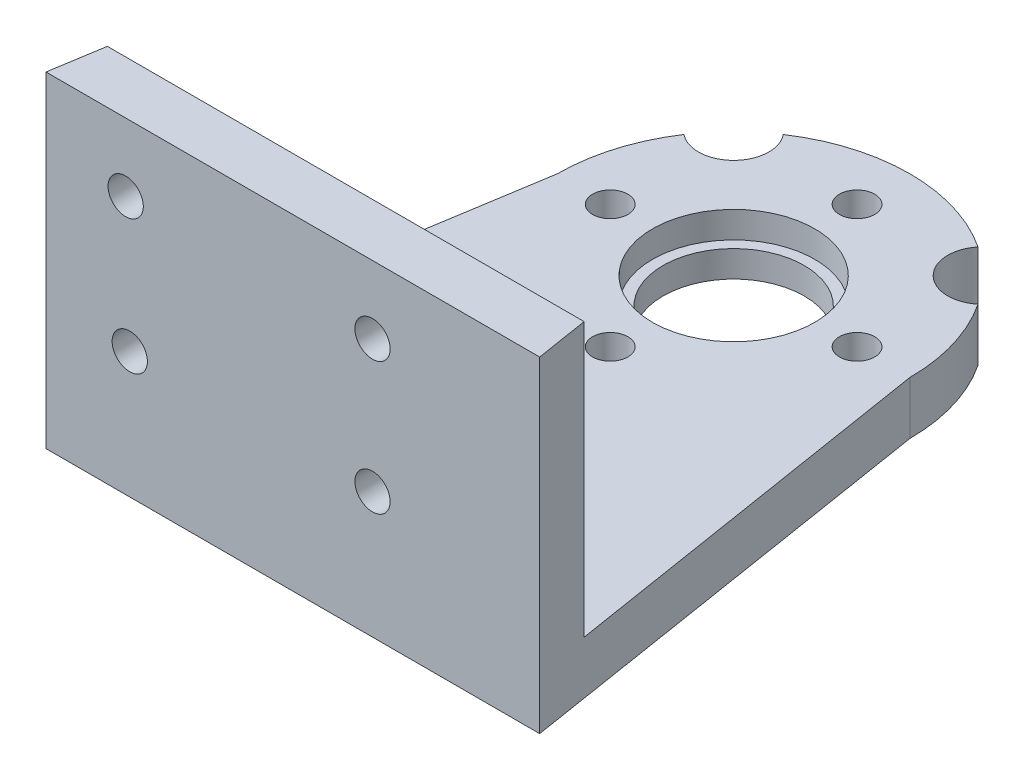
ISO-10303-21;
HEADER;
FILE_DESCRIPTION(('STEP AP214'),'2;1');
FILE_NAME('part.step','',(''),(''),'','','');
FILE_SCHEMA(('AUTOMOTIVE_DESIGN { 1 0 10303 214 1 1 1 1 }'));
ENDSEC;
DATA;
#1=APPLICATION_CONTEXT('core data for automotive mechanical design processes');
#2=APPLICATION_PROTOCOL_DEFINITION('international standard','automotive_design',2000,#1);
#3=PRODUCT_CONTEXT('',#1,'mechanical');
#4=PRODUCT('Part','Part','',(#3));
#5=PRODUCT_RELATED_PRODUCT_CATEGORY('part','',(#4));
#6=PRODUCT_DEFINITION_FORMATION('','',#4);
#7=PRODUCT_DEFINITION_CONTEXT('part definition',#1,'design');
#8=PRODUCT_DEFINITION('design','',#6,#7);
#9=PRODUCT_DEFINITION_SHAPE('','',#8);
#10=(LENGTH_UNIT() NAMED_UNIT(*) SI_UNIT(.MILLI.,.METRE.));
#11=(NAMED_UNIT(*) PLANE_ANGLE_UNIT() SI_UNIT($,.RADIAN.));
#12=(NAMED_UNIT(*) SI_UNIT($,.STERADIAN.) SOLID_ANGLE_UNIT());
#13=UNCERTAINTY_MEASURE_WITH_UNIT(LENGTH_MEASURE(1.E-05),#10,'distance_accuracy_value','');
#14=(GEOMETRIC_REPRESENTATION_CONTEXT(3) GLOBAL_UNCERTAINTY_ASSIGNED_CONTEXT((#13)) GLOBAL_UNIT_ASSIGNED_CONTEXT((#10,
#11,#12)) REPRESENTATION_CONTEXT('',''));
#15=CARTESIAN_POINT('',(0.,0.,0.));
#16=DIRECTION('',(0.,0.,1.));
#17=DIRECTION('',(1.,0.,0.));
#18=AXIS2_PLACEMENT_3D('',#15,#16,#17);
#19=CARTESIAN_POINT('',(0.,3.,0.));
#20=DIRECTION('',(0.,-1.,0.));
#21=DIRECTION('',(0.,0.,-1.));
#22=AXIS2_PLACEMENT_3D('',#19,#20,#21);
#23=CYLINDRICAL_SURFACE('',#22,10.);
#24=CARTESIAN_POINT('',(0.,0.,0.));
#25=DIRECTION('',(0.,1.,0.));
#26=DIRECTION('',(0.,0.,-1.));
#27=AXIS2_PLACEMENT_3D('',#24,#25,#26);
#28=CIRCLE('',#27,10.);
#29=CARTESIAN_POINT('',(10.,0.,0.));
#30=VERTEX_POINT('',#29);
#31=CARTESIAN_POINT('',(8.33677118357518,0.,-5.52252172768116));
#32=VERTEX_POINT('',#31);
#33=EDGE_CURVE('E221',#30,#32,#28,.T.);
#34=ORIENTED_EDGE('',*,*,#33,.T.);
#35=DIRECTION('',(0.,1.,0.));
#36=VECTOR('',#35,1.);
#37=CARTESIAN_POINT('',(8.33677118357519,-2.,-5.52252172768115));
#38=LINE('',#37,#36);
#39=CARTESIAN_POINT('',(8.33677118357519,3.,-5.52252172768115));
#40=VERTEX_POINT('',#39);
#41=EDGE_CURVE('E51',#32,#40,#38,.T.);
#42=ORIENTED_EDGE('',*,*,#41,.T.);
#43=CARTESIAN_POINT('',(0.,3.,0.));
#44=DIRECTION('',(0.,1.,0.));
#45=DIRECTION('',(0.,0.,-1.));
#46=AXIS2_PLACEMENT_3D('',#43,#44,#45);
#47=CIRCLE('',#46,10.);
#48=CARTESIAN_POINT('',(10.,3.,0.));
#49=VERTEX_POINT('',#48);
#50=EDGE_CURVE('E125',#49,#40,#47,.T.);
#51=ORIENTED_EDGE('',*,*,#50,.F.);
#52=DIRECTION('',(0.,-1.,0.));
#53=VECTOR('',#52,1.);
#54=CARTESIAN_POINT('',(10.,3.,0.));
#55=LINE('',#54,#53);
#56=EDGE_CURVE('E149',#49,#30,#55,.T.);
#57=ORIENTED_EDGE('',*,*,#56,.T.);
#58=EDGE_LOOP('',(#34,#42,#51,#57));
#59=FACE_BOUND('',#58,.T.);
#60=ADVANCED_FACE('F37',(#59),#23,.T.);
#61=CARTESIAN_POINT('',(5.52252172768112,3.,-8.33677118357521));
#62=VERTEX_POINT('',#61);
#63=CARTESIAN_POINT('',(-5.52252172768112,3.,-8.33677118357521));
#64=VERTEX_POINT('',#63);
#65=EDGE_CURVE('E122',#62,#64,#47,.T.);
#66=ORIENTED_EDGE('',*,*,#65,.F.);
#67=DIRECTION('',(0.,1.,0.));
#68=VECTOR('',#67,1.);
#69=CARTESIAN_POINT('',(5.52252172768112,-2.,-8.33677118357521));
#70=LINE('',#69,#68);
#71=CARTESIAN_POINT('',(5.52252172768113,0.,-8.3367711835752));
#72=VERTEX_POINT('',#71);
#73=EDGE_CURVE('E112',#62,#72,#70,.F.);
#74=ORIENTED_EDGE('',*,*,#73,.T.);
#75=CARTESIAN_POINT('',(-5.52252172768113,0.,-8.3367711835752));
#76=VERTEX_POINT('',#75);
#77=EDGE_CURVE('E59',#72,#76,#28,.T.);
#78=ORIENTED_EDGE('',*,*,#77,.T.);
#79=DIRECTION('',(0.,1.,0.));
#80=VECTOR('',#79,1.);
#81=CARTESIAN_POINT('',(-5.52252172768112,-2.,-8.33677118357521));
#82=LINE('',#81,#80);
#83=EDGE_CURVE('E129',#76,#64,#82,.T.);
#84=ORIENTED_EDGE('',*,*,#83,.T.);
#85=EDGE_LOOP('',(#66,#74,#78,#84));
#86=FACE_BOUND('',#85,.T.);
#87=ADVANCED_FACE('F128',(#86),#23,.T.);
#88=CARTESIAN_POINT('',(0.,-10.,0.));
#89=DIRECTION('',(0.,1.,0.));
#90=DIRECTION('',(0.,0.,1.));
#91=AXIS2_PLACEMENT_3D('',#88,#89,#90);
#92=CYLINDRICAL_SURFACE('',#91,4.);
#93=CARTESIAN_POINT('',(0.,0.,0.));
#94=DIRECTION('',(0.,-1.,0.));
#95=DIRECTION('',(0.,0.,-1.));
#96=AXIS2_PLACEMENT_3D('',#93,#94,#95);
#97=CIRCLE('',#96,4.);
#98=CARTESIAN_POINT('',(0.,0.,-4.));
#99=VERTEX_POINT('',#98);
#100=EDGE_CURVE('E217',#99,#99,#97,.T.);
#101=ORIENTED_EDGE('',*,*,#100,.T.);
#102=EDGE_LOOP('',(#101));
#103=FACE_BOUND('',#102,.T.);
#104=CARTESIAN_POINT('',(0.,1.5,0.));
#105=DIRECTION('',(0.,1.,0.));
#106=DIRECTION('',(0.,0.,1.));
#107=AXIS2_PLACEMENT_3D('',#104,#105,#106);
#108=CIRCLE('',#107,4.);
#109=CARTESIAN_POINT('',(0.,1.5,4.));
#110=VERTEX_POINT('',#109);
#111=EDGE_CURVE('E155',#110,#110,#108,.F.);
#112=ORIENTED_EDGE('',*,*,#111,.F.);
#113=EDGE_LOOP('',(#112));
#114=FACE_BOUND('',#113,.T.);
#115=ADVANCED_FACE('F352',(#103,#114),#92,.F.);
#116=CARTESIAN_POINT('',(0.,3.,0.));
#117=DIRECTION('',(0.,-1.,0.));
#118=DIRECTION('',(0.,0.,-1.));
#119=AXIS2_PLACEMENT_3D('',#116,#117,#118);
#120=PLANE('',#119);
#121=CARTESIAN_POINT('',(0.,3.,0.));
#122=DIRECTION('',(0.,1.,0.));
#123=DIRECTION('',(0.,0.,1.));
#124=AXIS2_PLACEMENT_3D('',#121,#122,#123);
#125=CIRCLE('',#124,4.6);
#126=CARTESIAN_POINT('',(0.,3.,4.6));
#127=VERTEX_POINT('',#126);
#128=EDGE_CURVE('E276',#127,#127,#125,.T.);
#129=ORIENTED_EDGE('',*,*,#128,.F.);
#130=EDGE_LOOP('',(#129));
#131=FACE_BOUND('',#130,.T.);
#132=CARTESIAN_POINT('',(-6.52,3.,19.));
#133=DIRECTION('',(0.,1.,0.));
#134=DIRECTION('',(0.,0.,1.));
#135=AXIS2_PLACEMENT_3D('',#132,#133,#134);
#136=CIRCLE('',#135,1.);
#137=CARTESIAN_POINT('',(-6.52,3.,20.));
#138=VERTEX_POINT('',#137);
#139=EDGE_CURVE('E136',#138,#138,#136,.T.);
#140=ORIENTED_EDGE('',*,*,#139,.F.);
#141=EDGE_LOOP('',(#140));
#142=FACE_BOUND('',#141,.T.);
#143=CARTESIAN_POINT('',(6.52,3.,19.));
#144=DIRECTION('',(0.,1.,0.));
#145=DIRECTION('',(0.,0.,-1.));
#146=AXIS2_PLACEMENT_3D('',#143,#144,#145);
#147=CIRCLE('',#146,1.);
#148=CARTESIAN_POINT('',(6.52,3.,18.));
#149=VERTEX_POINT('',#148);
#150=EDGE_CURVE('E190',#149,#149,#147,.T.);
#151=ORIENTED_EDGE('',*,*,#150,.F.);
#152=EDGE_LOOP('',(#151));
#153=FACE_BOUND('',#152,.T.);
#154=CARTESIAN_POINT('',(0.,3.,19.));
#155=DIRECTION('',(0.,1.,0.));
#156=DIRECTION('',(0.,0.,1.));
#157=AXIS2_PLACEMENT_3D('',#154,#155,#156);
#158=CIRCLE('',#157,1.);
#159=CARTESIAN_POINT('',(0.,3.,20.));
#160=VERTEX_POINT('',#159);
#161=EDGE_CURVE('E186',#160,#160,#158,.T.);
#162=ORIENTED_EDGE('',*,*,#161,.F.);
#163=EDGE_LOOP('',(#162));
#164=FACE_BOUND('',#163,.T.);
#165=CARTESIAN_POINT('',(0.,3.,7.));
#166=DIRECTION('',(0.,1.,0.));
#167=DIRECTION('',(0.,0.,1.));
#168=AXIS2_PLACEMENT_3D('',#165,#166,#167);
#169=CIRCLE('',#168,1.);
#170=CARTESIAN_POINT('',(0.,3.,8.));
#171=VERTEX_POINT('',#170);
#172=EDGE_CURVE('E180',#171,#171,#169,.T.);
#173=ORIENTED_EDGE('',*,*,#172,.F.);
#174=EDGE_LOOP('',(#173));
#175=FACE_BOUND('',#174,.T.);
#176=CARTESIAN_POINT('',(-7.,3.,0.));
#177=DIRECTION('',(0.,1.,0.));
#178=DIRECTION('',(0.,0.,1.));
#179=AXIS2_PLACEMENT_3D('',#176,#177,#178);
#180=CIRCLE('',#179,1.);
#181=CARTESIAN_POINT('',(-7.,3.,0.999999999999975));
#182=VERTEX_POINT('',#181);
#183=EDGE_CURVE('E174',#182,#182,#180,.T.);
#184=ORIENTED_EDGE('',*,*,#183,.F.);
#185=EDGE_LOOP('',(#184));
#186=FACE_BOUND('',#185,.T.);
#187=CARTESIAN_POINT('',(0.,3.,-7.));
#188=DIRECTION('',(0.,1.,0.));
#189=DIRECTION('',(0.,0.,1.));
#190=AXIS2_PLACEMENT_3D('',#187,#188,#189);
#191=CIRCLE('',#190,1.);
#192=CARTESIAN_POINT('',(0.,3.,-6.));
#193=VERTEX_POINT('',#192);
#194=EDGE_CURVE('E166',#193,#193,#191,.T.);
#195=ORIENTED_EDGE('',*,*,#194,.F.);
#196=EDGE_LOOP('',(#195));
#197=FACE_BOUND('',#196,.T.);
#198=CARTESIAN_POINT('',(7.,3.,0.));
#199=DIRECTION('',(0.,1.,0.));
#200=DIRECTION('',(0.,0.,1.));
#201=AXIS2_PLACEMENT_3D('',#198,#199,#200);
#202=CIRCLE('',#201,1.);
#203=CARTESIAN_POINT('',(7.,3.,1.00000000000007));
#204=VERTEX_POINT('',#203);
#205=EDGE_CURVE('E167',#204,#204,#202,.T.);
#206=ORIENTED_EDGE('',*,*,#205,.F.);
#207=EDGE_LOOP('',(#206));
#208=FACE_BOUND('',#207,.T.);
#209=ORIENTED_EDGE('',*,*,#50,.T.);
#210=CARTESIAN_POINT('',(7.07106781186546,3.,-7.07106781186549));
#211=DIRECTION('',(0.,1.,0.));
#212=DIRECTION('',(0.,0.,-1.));
#213=AXIS2_PLACEMENT_3D('',#210,#211,#212);
#214=CIRCLE('',#213,2.);
#215=EDGE_CURVE('E115',#62,#40,#214,.T.);
#216=ORIENTED_EDGE('',*,*,#215,.F.);
#217=ORIENTED_EDGE('',*,*,#65,.T.);
#218=CARTESIAN_POINT('',(-7.07106781186546,3.,-7.07106781186549));
#219=DIRECTION('',(0.,1.,0.));
#220=DIRECTION('',(0.,0.,1.));
#221=AXIS2_PLACEMENT_3D('',#218,#219,#220);
#222=CIRCLE('',#221,2.);
#223=CARTESIAN_POINT('',(-8.33677118357519,3.,-5.52252172768115));
#224=VERTEX_POINT('',#223);
#225=EDGE_CURVE('E284',#224,#64,#222,.T.);
#226=ORIENTED_EDGE('',*,*,#225,.F.);
#227=CARTESIAN_POINT('',(-10.,3.,0.));
#228=VERTEX_POINT('',#227);
#229=EDGE_CURVE('E130',#224,#228,#47,.T.);
#230=ORIENTED_EDGE('',*,*,#229,.T.);
#231=DIRECTION('',(-0.157990501106673,0.,0.987440631916705));
#232=VECTOR('',#231,1.);
#233=CARTESIAN_POINT('',(-10.,3.,0.));
#234=LINE('',#233,#232);
#235=CARTESIAN_POINT('',(-13.52,3.,22.));
#236=VERTEX_POINT('',#235);
#237=EDGE_CURVE('E132',#228,#236,#234,.T.);
#238=ORIENTED_EDGE('',*,*,#237,.T.);
#239=DIRECTION('',(-1.,0.,0.));
#240=VECTOR('',#239,1.);
#241=CARTESIAN_POINT('',(-13.52,3.,22.));
#242=LINE('',#241,#240);
#243=CARTESIAN_POINT('',(13.52,3.,22.));
#244=VERTEX_POINT('',#243);
#245=EDGE_CURVE('E150',#244,#236,#242,.T.);
#246=ORIENTED_EDGE('',*,*,#245,.F.);
#247=DIRECTION('',(-0.157990501106673,0.,-0.987440631916705));
#248=VECTOR('',#247,1.);
#249=CARTESIAN_POINT('',(10.,3.,0.));
#250=LINE('',#249,#248);
#251=EDGE_CURVE('E145',#244,#49,#250,.T.);
#252=ORIENTED_EDGE('',*,*,#251,.T.);
#253=EDGE_LOOP('',(#209,#216,#217,#226,#230,#238,#246,#252));
#254=FACE_BOUND('',#253,.T.);
#255=ADVANCED_FACE('F120',(#131,#142,#153,#164,#175,#186,#197,#208,#254),#120,.F.);
#256=ORIENTED_EDGE('',*,*,#229,.F.);
#257=DIRECTION('',(0.,1.,0.));
#258=VECTOR('',#257,1.);
#259=CARTESIAN_POINT('',(-8.33677118357519,-2.,-5.52252172768115));
#260=LINE('',#259,#258);
#261=CARTESIAN_POINT('',(-8.33677118357518,0.,-5.52252172768116));
#262=VERTEX_POINT('',#261);
#263=EDGE_CURVE('E282',#224,#262,#260,.F.);
#264=ORIENTED_EDGE('',*,*,#263,.T.);
#265=CARTESIAN_POINT('',(-10.,0.,0.));
#266=VERTEX_POINT('',#265);
#267=EDGE_CURVE('E219',#262,#266,#28,.T.);
#268=ORIENTED_EDGE('',*,*,#267,.T.);
#269=DIRECTION('',(0.,-1.,0.));
#270=VECTOR('',#269,1.);
#271=CARTESIAN_POINT('',(-10.,3.,0.));
#272=LINE('',#271,#270);
#273=EDGE_CURVE('E224',#228,#266,#272,.T.);
#274=ORIENTED_EDGE('',*,*,#273,.F.);
#275=EDGE_LOOP('',(#256,#264,#268,#274));
#276=FACE_BOUND('',#275,.T.);
#277=ADVANCED_FACE('F39',(#276),#23,.T.);
#278=CARTESIAN_POINT('',(-10.,3.,0.));
#279=DIRECTION('',(0.987440631916705,0.,0.157990501106673));
#280=DIRECTION('',(0.157990501106673,0.,-0.987440631916705));
#281=AXIS2_PLACEMENT_3D('',#278,#279,#280);
#282=PLANE('',#281);
#283=DIRECTION('',(-0.157990501106673,0.,0.987440631916705));
#284=VECTOR('',#283,1.);
#285=CARTESIAN_POINT('',(-10.,0.,0.));
#286=LINE('',#285,#284);
#287=CARTESIAN_POINT('',(-14.,0.,25.));
#288=VERTEX_POINT('',#287);
#289=EDGE_CURVE('E238',#266,#288,#286,.T.);
#290=ORIENTED_EDGE('',*,*,#289,.T.);
#291=DIRECTION('',(0.,-1.,0.));
#292=VECTOR('',#291,1.);
#293=CARTESIAN_POINT('',(-14.,3.,25.));
#294=LINE('',#293,#292);
#295=CARTESIAN_POINT('',(-14.,18.5,25.));
#296=VERTEX_POINT('',#295);
#297=EDGE_CURVE('E227',#296,#288,#294,.T.);
#298=ORIENTED_EDGE('',*,*,#297,.F.);
#299=DIRECTION('',(-0.157990501106673,0.,0.987440631916705));
#300=VECTOR('',#299,1.);
#301=CARTESIAN_POINT('',(-13.52,18.5,22.));
#302=LINE('',#301,#300);
#303=CARTESIAN_POINT('',(-13.52,18.5,22.));
#304=VERTEX_POINT('',#303);
#305=EDGE_CURVE('E154',#304,#296,#302,.T.);
#306=ORIENTED_EDGE('',*,*,#305,.F.);
#307=DIRECTION('',(0.,-1.,0.));
#308=VECTOR('',#307,1.);
#309=CARTESIAN_POINT('',(-13.52,18.5,22.));
#310=LINE('',#309,#308);
#311=EDGE_CURVE('E156',#304,#236,#310,.T.);
#312=ORIENTED_EDGE('',*,*,#311,.T.);
#313=ORIENTED_EDGE('',*,*,#237,.F.);
#314=ORIENTED_EDGE('',*,*,#273,.T.);
#315=EDGE_LOOP('',(#290,#298,#306,#312,#313,#314));
#316=FACE_BOUND('',#315,.T.);
#317=ADVANCED_FACE('F330',(#316),#282,.F.);
#318=CARTESIAN_POINT('',(-14.,3.,25.));
#319=DIRECTION('',(0.,0.,-1.));
#320=DIRECTION('',(-1.,0.,0.));
#321=AXIS2_PLACEMENT_3D('',#318,#319,#320);
#322=PLANE('',#321);
#323=CARTESIAN_POINT('',(-9.24883244461862,7.15183711810638,25.));
#324=DIRECTION('',(0.,0.,-1.));
#325=DIRECTION('',(-1.,0.,0.));
#326=AXIS2_PLACEMENT_3D('',#323,#324,#325);
#327=CIRCLE('',#326,1.00000000002276);
#328=CARTESIAN_POINT('',(-10.2488324446414,7.15183711810638,25.));
#329=VERTEX_POINT('',#328);
#330=EDGE_CURVE('E304',#329,#329,#327,.T.);
#331=ORIENTED_EDGE('',*,*,#330,.T.);
#332=EDGE_LOOP('',(#331));
#333=FACE_BOUND('',#332,.T.);
#334=CARTESIAN_POINT('',(-9.48122486488474,14.6518371181064,25.));
#335=DIRECTION('',(0.,0.,-1.));
#336=DIRECTION('',(-1.,0.,0.));
#337=AXIS2_PLACEMENT_3D('',#334,#335,#336);
#338=CIRCLE('',#337,1.00000000002276);
#339=CARTESIAN_POINT('',(-10.4812248649075,14.6518371181064,25.));
#340=VERTEX_POINT('',#339);
#341=EDGE_CURVE('E298',#340,#340,#338,.T.);
#342=ORIENTED_EDGE('',*,*,#341,.T.);
#343=EDGE_LOOP('',(#342));
#344=FACE_BOUND('',#343,.T.);
#345=CARTESIAN_POINT('',(4.51877513511526,14.6518371181064,25.));
#346=DIRECTION('',(0.,0.,-1.));
#347=DIRECTION('',(-1.,0.,0.));
#348=AXIS2_PLACEMENT_3D('',#345,#346,#347);
#349=CIRCLE('',#348,1.00000000002276);
#350=CARTESIAN_POINT('',(3.5187751350925,14.6518371181064,25.));
#351=VERTEX_POINT('',#350);
#352=EDGE_CURVE('E292',#351,#351,#349,.T.);
#353=ORIENTED_EDGE('',*,*,#352,.T.);
#354=EDGE_LOOP('',(#353));
#355=FACE_BOUND('',#354,.T.);
#356=CARTESIAN_POINT('',(4.51877513511526,7.15183711810639,25.));
#357=DIRECTION('',(0.,0.,-1.));
#358=DIRECTION('',(-1.,0.,0.));
#359=AXIS2_PLACEMENT_3D('',#356,#357,#358);
#360=CIRCLE('',#359,1.00000000002276);
#361=CARTESIAN_POINT('',(3.5187751350925,7.15183711810639,25.));
#362=VERTEX_POINT('',#361);
#363=EDGE_CURVE('E126',#362,#362,#360,.T.);
#364=ORIENTED_EDGE('',*,*,#363,.T.);
#365=EDGE_LOOP('',(#364));
#366=FACE_BOUND('',#365,.T.);
#367=DIRECTION('',(1.,0.,0.));
#368=VECTOR('',#367,1.);
#369=CARTESIAN_POINT('',(-14.,0.,25.));
#370=LINE('',#369,#368);
#371=CARTESIAN_POINT('',(14.,0.,25.));
#372=VERTEX_POINT('',#371);
#373=EDGE_CURVE('E236',#288,#372,#370,.T.);
#374=ORIENTED_EDGE('',*,*,#373,.T.);
#375=DIRECTION('',(0.,-1.,0.));
#376=VECTOR('',#375,1.);
#377=CARTESIAN_POINT('',(14.,3.,25.));
#378=LINE('',#377,#376);
#379=CARTESIAN_POINT('',(14.,18.5,25.));
#380=VERTEX_POINT('',#379);
#381=EDGE_CURVE('E230',#380,#372,#378,.T.);
#382=ORIENTED_EDGE('',*,*,#381,.F.);
#383=DIRECTION('',(1.,0.,0.));
#384=VECTOR('',#383,1.);
#385=CARTESIAN_POINT('',(-14.,18.5,25.));
#386=LINE('',#385,#384);
#387=EDGE_CURVE('E270',#296,#380,#386,.T.);
#388=ORIENTED_EDGE('',*,*,#387,.F.);
#389=ORIENTED_EDGE('',*,*,#297,.T.);
#390=EDGE_LOOP('',(#374,#382,#388,#389));
#391=FACE_BOUND('',#390,.T.);
#392=ADVANCED_FACE('F329',(#333,#344,#355,#366,#391),#322,.F.);
#393=CARTESIAN_POINT('',(10.,3.,0.));
#394=DIRECTION('',(-0.987440631916705,0.,0.157990501106673));
#395=DIRECTION('',(0.157990501106673,0.,0.987440631916705));
#396=AXIS2_PLACEMENT_3D('',#393,#394,#395);
#397=PLANE('',#396);
#398=DIRECTION('',(-0.157990501106673,0.,-0.987440631916705));
#399=VECTOR('',#398,1.);
#400=CARTESIAN_POINT('',(10.,0.,0.));
#401=LINE('',#400,#399);
#402=EDGE_CURVE('E133',#372,#30,#401,.T.);
#403=ORIENTED_EDGE('',*,*,#402,.T.);
#404=ORIENTED_EDGE('',*,*,#56,.F.);
#405=ORIENTED_EDGE('',*,*,#251,.F.);
#406=DIRECTION('',(0.,-1.,0.));
#407=VECTOR('',#406,1.);
#408=CARTESIAN_POINT('',(13.52,18.5,22.));
#409=LINE('',#408,#407);
#410=CARTESIAN_POINT('',(13.52,18.5,22.));
#411=VERTEX_POINT('',#410);
#412=EDGE_CURVE('E170',#411,#244,#409,.T.);
#413=ORIENTED_EDGE('',*,*,#412,.F.);
#414=DIRECTION('',(-0.157990501106673,0.,-0.987440631916705));
#415=VECTOR('',#414,1.);
#416=CARTESIAN_POINT('',(14.,18.5,25.));
#417=LINE('',#416,#415);
#418=EDGE_CURVE('E267',#380,#411,#417,.T.);
#419=ORIENTED_EDGE('',*,*,#418,.F.);
#420=ORIENTED_EDGE('',*,*,#381,.T.);
#421=EDGE_LOOP('',(#403,#404,#405,#413,#419,#420));
#422=FACE_BOUND('',#421,.T.);
#423=ADVANCED_FACE('F206',(#422),#397,.F.);
#424=CARTESIAN_POINT('',(0.,0.,0.));
#425=DIRECTION('',(0.,-1.,0.));
#426=DIRECTION('',(0.,0.,-1.));
#427=AXIS2_PLACEMENT_3D('',#424,#425,#426);
#428=PLANE('',#427);
#429=CARTESIAN_POINT('',(7.07106781186546,0.,-7.07106781186549));
#430=DIRECTION('',(0.,-1.,0.));
#431=DIRECTION('',(0.,0.,-1.));
#432=AXIS2_PLACEMENT_3D('',#429,#430,#431);
#433=CIRCLE('',#432,2.);
#434=EDGE_CURVE('E11',#32,#72,#433,.T.);
#435=ORIENTED_EDGE('',*,*,#434,.F.);
#436=ORIENTED_EDGE('',*,*,#33,.F.);
#437=ORIENTED_EDGE('',*,*,#402,.F.);
#438=ORIENTED_EDGE('',*,*,#373,.F.);
#439=ORIENTED_EDGE('',*,*,#289,.F.);
#440=ORIENTED_EDGE('',*,*,#267,.F.);
#441=CARTESIAN_POINT('',(-7.07106781186546,0.,-7.07106781186549));
#442=DIRECTION('',(0.,-1.,0.));
#443=DIRECTION('',(0.,0.,-1.));
#444=AXIS2_PLACEMENT_3D('',#441,#442,#443);
#445=CIRCLE('',#444,2.);
#446=EDGE_CURVE('E45',#76,#262,#445,.T.);
#447=ORIENTED_EDGE('',*,*,#446,.F.);
#448=ORIENTED_EDGE('',*,*,#77,.F.);
#449=EDGE_LOOP('',(#435,#436,#437,#438,#439,#440,#447,#448));
#450=FACE_BOUND('',#449,.T.);
#451=CARTESIAN_POINT('',(7.,0.,0.));
#452=DIRECTION('',(0.,1.,0.));
#453=DIRECTION('',(0.,0.,1.));
#454=AXIS2_PLACEMENT_3D('',#451,#452,#453);
#455=CIRCLE('',#454,1.);
#456=CARTESIAN_POINT('',(7.,0.,1.00000000000007));
#457=VERTEX_POINT('',#456);
#458=EDGE_CURVE('E163',#457,#457,#455,.T.);
#459=ORIENTED_EDGE('',*,*,#458,.T.);
#460=EDGE_LOOP('',(#459));
#461=FACE_BOUND('',#460,.T.);
#462=CARTESIAN_POINT('',(0.,0.,-7.));
#463=DIRECTION('',(0.,1.,0.));
#464=DIRECTION('',(0.,0.,1.));
#465=AXIS2_PLACEMENT_3D('',#462,#463,#464);
#466=CIRCLE('',#465,1.);
#467=CARTESIAN_POINT('',(0.,0.,-6.));
#468=VERTEX_POINT('',#467);
#469=EDGE_CURVE('E171',#468,#468,#466,.T.);
#470=ORIENTED_EDGE('',*,*,#469,.T.);
#471=EDGE_LOOP('',(#470));
#472=FACE_BOUND('',#471,.T.);
#473=CARTESIAN_POINT('',(-7.,0.,0.));
#474=DIRECTION('',(0.,1.,0.));
#475=DIRECTION('',(0.,0.,1.));
#476=AXIS2_PLACEMENT_3D('',#473,#474,#475);
#477=CIRCLE('',#476,1.);
#478=CARTESIAN_POINT('',(-7.,0.,0.999999999999975));
#479=VERTEX_POINT('',#478);
#480=EDGE_CURVE('E177',#479,#479,#477,.T.);
#481=ORIENTED_EDGE('',*,*,#480,.T.);
#482=EDGE_LOOP('',(#481));
#483=FACE_BOUND('',#482,.T.);
#484=CARTESIAN_POINT('',(0.,0.,7.));
#485=DIRECTION('',(0.,1.,0.));
#486=DIRECTION('',(0.,0.,1.));
#487=AXIS2_PLACEMENT_3D('',#484,#485,#486);
#488=CIRCLE('',#487,1.);
#489=CARTESIAN_POINT('',(0.,0.,8.));
#490=VERTEX_POINT('',#489);
#491=EDGE_CURVE('E183',#490,#490,#488,.T.);
#492=ORIENTED_EDGE('',*,*,#491,.T.);
#493=EDGE_LOOP('',(#492));
#494=FACE_BOUND('',#493,.T.);
#495=CARTESIAN_POINT('',(0.,0.,19.));
#496=DIRECTION('',(0.,-1.,0.));
#497=DIRECTION('',(0.,0.,-1.));
#498=AXIS2_PLACEMENT_3D('',#495,#496,#497);
#499=CIRCLE('',#498,1.);
#500=CARTESIAN_POINT('',(0.,0.,18.));
#501=VERTEX_POINT('',#500);
#502=EDGE_CURVE('E146',#501,#501,#499,.T.);
#503=ORIENTED_EDGE('',*,*,#502,.F.);
#504=EDGE_LOOP('',(#503));
#505=FACE_BOUND('',#504,.T.);
#506=CARTESIAN_POINT('',(6.52,0.,19.));
#507=DIRECTION('',(0.,-1.,0.));
#508=DIRECTION('',(0.,0.,-1.));
#509=AXIS2_PLACEMENT_3D('',#506,#507,#508);
#510=CIRCLE('',#509,1.);
#511=CARTESIAN_POINT('',(6.52,0.,18.));
#512=VERTEX_POINT('',#511);
#513=EDGE_CURVE('E192',#512,#512,#510,.T.);
#514=ORIENTED_EDGE('',*,*,#513,.F.);
#515=EDGE_LOOP('',(#514));
#516=FACE_BOUND('',#515,.T.);
#517=CARTESIAN_POINT('',(-6.52,0.,19.));
#518=DIRECTION('',(0.,-1.,0.));
#519=DIRECTION('',(0.,0.,-1.));
#520=AXIS2_PLACEMENT_3D('',#517,#518,#519);
#521=CIRCLE('',#520,1.);
#522=CARTESIAN_POINT('',(-6.52,0.,18.));
#523=VERTEX_POINT('',#522);
#524=EDGE_CURVE('E214',#523,#523,#521,.T.);
#525=ORIENTED_EDGE('',*,*,#524,.F.);
#526=EDGE_LOOP('',(#525));
#527=FACE_BOUND('',#526,.T.);
#528=ORIENTED_EDGE('',*,*,#100,.F.);
#529=EDGE_LOOP('',(#528));
#530=FACE_BOUND('',#529,.T.);
#531=ADVANCED_FACE('F202',(#450,#461,#472,#483,#494,#505,#516,#527,#530),#428,.T.);
#532=CARTESIAN_POINT('',(-6.52,-10.,19.));
#533=DIRECTION('',(0.,1.,0.));
#534=DIRECTION('',(0.,0.,1.));
#535=AXIS2_PLACEMENT_3D('',#532,#533,#534);
#536=CYLINDRICAL_SURFACE('',#535,1.);
#537=ORIENTED_EDGE('',*,*,#524,.T.);
#538=EDGE_LOOP('',(#537));
#539=FACE_BOUND('',#538,.T.);
#540=ORIENTED_EDGE('',*,*,#139,.T.);
#541=EDGE_LOOP('',(#540));
#542=FACE_BOUND('',#541,.T.);
#543=ADVANCED_FACE('F205',(#539,#542),#536,.F.);
#544=CARTESIAN_POINT('',(6.52,-10.,19.));
#545=DIRECTION('',(0.,1.,0.));
#546=DIRECTION('',(0.,0.,1.));
#547=AXIS2_PLACEMENT_3D('',#544,#545,#546);
#548=CYLINDRICAL_SURFACE('',#547,1.);
#549=ORIENTED_EDGE('',*,*,#513,.T.);
#550=EDGE_LOOP('',(#549));
#551=FACE_BOUND('',#550,.T.);
#552=ORIENTED_EDGE('',*,*,#150,.T.);
#553=EDGE_LOOP('',(#552));
#554=FACE_BOUND('',#553,.T.);
#555=ADVANCED_FACE('F490',(#551,#554),#548,.F.);
#556=CARTESIAN_POINT('',(0.,-10.,19.));
#557=DIRECTION('',(0.,1.,0.));
#558=DIRECTION('',(0.,0.,1.));
#559=AXIS2_PLACEMENT_3D('',#556,#557,#558);
#560=CYLINDRICAL_SURFACE('',#559,1.);
#561=ORIENTED_EDGE('',*,*,#502,.T.);
#562=EDGE_LOOP('',(#561));
#563=FACE_BOUND('',#562,.T.);
#564=ORIENTED_EDGE('',*,*,#161,.T.);
#565=EDGE_LOOP('',(#564));
#566=FACE_BOUND('',#565,.T.);
#567=ADVANCED_FACE('F199',(#563,#566),#560,.F.);
#568=CARTESIAN_POINT('',(0.,0.,7.));
#569=DIRECTION('',(0.,1.,0.));
#570=DIRECTION('',(0.,0.,1.));
#571=AXIS2_PLACEMENT_3D('',#568,#569,#570);
#572=CYLINDRICAL_SURFACE('',#571,1.);
#573=ORIENTED_EDGE('',*,*,#491,.F.);
#574=EDGE_LOOP('',(#573));
#575=FACE_BOUND('',#574,.T.);
#576=ORIENTED_EDGE('',*,*,#172,.T.);
#577=EDGE_LOOP('',(#576));
#578=FACE_BOUND('',#577,.T.);
#579=ADVANCED_FACE('F503',(#575,#578),#572,.F.);
#580=CARTESIAN_POINT('',(-7.,0.,0.));
#581=DIRECTION('',(0.,1.,0.));
#582=DIRECTION('',(0.,0.,1.));
#583=AXIS2_PLACEMENT_3D('',#580,#581,#582);
#584=CYLINDRICAL_SURFACE('',#583,1.);
#585=ORIENTED_EDGE('',*,*,#480,.F.);
#586=EDGE_LOOP('',(#585));
#587=FACE_BOUND('',#586,.T.);
#588=ORIENTED_EDGE('',*,*,#183,.T.);
#589=EDGE_LOOP('',(#588));
#590=FACE_BOUND('',#589,.T.);
#591=ADVANCED_FACE('F510',(#587,#590),#584,.F.);
#592=CARTESIAN_POINT('',(0.,0.,-7.));
#593=DIRECTION('',(0.,1.,0.));
#594=DIRECTION('',(0.,0.,1.));
#595=AXIS2_PLACEMENT_3D('',#592,#593,#594);
#596=CYLINDRICAL_SURFACE('',#595,1.);
#597=ORIENTED_EDGE('',*,*,#469,.F.);
#598=EDGE_LOOP('',(#597));
#599=FACE_BOUND('',#598,.T.);
#600=ORIENTED_EDGE('',*,*,#194,.T.);
#601=EDGE_LOOP('',(#600));
#602=FACE_BOUND('',#601,.T.);
#603=ADVANCED_FACE('F517',(#599,#602),#596,.F.);
#604=CARTESIAN_POINT('',(7.,0.,0.));
#605=DIRECTION('',(0.,1.,0.));
#606=DIRECTION('',(0.,0.,1.));
#607=AXIS2_PLACEMENT_3D('',#604,#605,#606);
#608=CYLINDRICAL_SURFACE('',#607,1.);
#609=ORIENTED_EDGE('',*,*,#458,.F.);
#610=EDGE_LOOP('',(#609));
#611=FACE_BOUND('',#610,.T.);
#612=ORIENTED_EDGE('',*,*,#205,.T.);
#613=EDGE_LOOP('',(#612));
#614=FACE_BOUND('',#613,.T.);
#615=ADVANCED_FACE('F318',(#611,#614),#608,.F.);
#616=CARTESIAN_POINT('',(-13.52,18.5,22.));
#617=DIRECTION('',(0.,0.,1.));
#618=DIRECTION('',(1.,0.,0.));
#619=AXIS2_PLACEMENT_3D('',#616,#617,#618);
#620=PLANE('',#619);
#621=CARTESIAN_POINT('',(-9.24883244461862,7.15183711810638,22.));
#622=DIRECTION('',(0.,0.,-1.));
#623=DIRECTION('',(-1.,0.,0.));
#624=AXIS2_PLACEMENT_3D('',#621,#622,#623);
#625=CIRCLE('',#624,1.00000000002276);
#626=CARTESIAN_POINT('',(-10.2488324446414,7.15183711810638,22.));
#627=VERTEX_POINT('',#626);
#628=EDGE_CURVE('E307',#627,#627,#625,.T.);
#629=ORIENTED_EDGE('',*,*,#628,.F.);
#630=EDGE_LOOP('',(#629));
#631=FACE_BOUND('',#630,.T.);
#632=CARTESIAN_POINT('',(-9.48122486488474,14.6518371181064,22.));
#633=DIRECTION('',(0.,0.,-1.));
#634=DIRECTION('',(-1.,0.,0.));
#635=AXIS2_PLACEMENT_3D('',#632,#633,#634);
#636=CIRCLE('',#635,1.00000000002276);
#637=CARTESIAN_POINT('',(-10.4812248649075,14.6518371181064,22.));
#638=VERTEX_POINT('',#637);
#639=EDGE_CURVE('E301',#638,#638,#636,.T.);
#640=ORIENTED_EDGE('',*,*,#639,.F.);
#641=EDGE_LOOP('',(#640));
#642=FACE_BOUND('',#641,.T.);
#643=CARTESIAN_POINT('',(4.51877513511526,14.6518371181064,22.));
#644=DIRECTION('',(0.,0.,-1.));
#645=DIRECTION('',(-1.,0.,0.));
#646=AXIS2_PLACEMENT_3D('',#643,#644,#645);
#647=CIRCLE('',#646,1.00000000002276);
#648=CARTESIAN_POINT('',(3.5187751350925,14.6518371181064,22.));
#649=VERTEX_POINT('',#648);
#650=EDGE_CURVE('E295',#649,#649,#647,.T.);
#651=ORIENTED_EDGE('',*,*,#650,.F.);
#652=EDGE_LOOP('',(#651));
#653=FACE_BOUND('',#652,.T.);
#654=CARTESIAN_POINT('',(4.51877513511526,7.15183711810639,22.));
#655=DIRECTION('',(0.,0.,-1.));
#656=DIRECTION('',(-1.,0.,0.));
#657=AXIS2_PLACEMENT_3D('',#654,#655,#656);
#658=CIRCLE('',#657,1.00000000002276);
#659=CARTESIAN_POINT('',(3.5187751350925,7.15183711810639,22.));
#660=VERTEX_POINT('',#659);
#661=EDGE_CURVE('E289',#660,#660,#658,.T.);
#662=ORIENTED_EDGE('',*,*,#661,.F.);
#663=EDGE_LOOP('',(#662));
#664=FACE_BOUND('',#663,.T.);
#665=ORIENTED_EDGE('',*,*,#245,.T.);
#666=ORIENTED_EDGE('',*,*,#311,.F.);
#667=DIRECTION('',(-1.,0.,0.));
#668=VECTOR('',#667,1.);
#669=CARTESIAN_POINT('',(-13.52,18.5,22.));
#670=LINE('',#669,#668);
#671=EDGE_CURVE('E161',#411,#304,#670,.T.);
#672=ORIENTED_EDGE('',*,*,#671,.F.);
#673=ORIENTED_EDGE('',*,*,#412,.T.);
#674=EDGE_LOOP('',(#665,#666,#672,#673));
#675=FACE_BOUND('',#674,.T.);
#676=ADVANCED_FACE('F314',(#631,#642,#653,#664,#675),#620,.F.);
#677=CARTESIAN_POINT('',(0.,18.5,0.));
#678=DIRECTION('',(0.,1.,0.));
#679=DIRECTION('',(0.,0.,1.));
#680=AXIS2_PLACEMENT_3D('',#677,#678,#679);
#681=PLANE('',#680);
#682=ORIENTED_EDGE('',*,*,#305,.T.);
#683=ORIENTED_EDGE('',*,*,#387,.T.);
#684=ORIENTED_EDGE('',*,*,#418,.T.);
#685=ORIENTED_EDGE('',*,*,#671,.T.);
#686=EDGE_LOOP('',(#682,#683,#684,#685));
#687=FACE_BOUND('',#686,.T.);
#688=ADVANCED_FACE('F317',(#687),#681,.T.);
#689=CARTESIAN_POINT('',(0.,1.5,0.));
#690=DIRECTION('',(0.,1.,0.));
#691=DIRECTION('',(0.,0.,1.));
#692=AXIS2_PLACEMENT_3D('',#689,#690,#691);
#693=PLANE('',#692);
#694=CARTESIAN_POINT('',(0.,1.5,0.));
#695=DIRECTION('',(0.,1.,0.));
#696=DIRECTION('',(0.,0.,1.));
#697=AXIS2_PLACEMENT_3D('',#694,#695,#696);
#698=CIRCLE('',#697,4.6);
#699=CARTESIAN_POINT('',(0.,1.5,4.6));
#700=VERTEX_POINT('',#699);
#701=EDGE_CURVE('E254',#700,#700,#698,.T.);
#702=ORIENTED_EDGE('',*,*,#701,.T.);
#703=EDGE_LOOP('',(#702));
#704=FACE_BOUND('',#703,.T.);
#705=ORIENTED_EDGE('',*,*,#111,.T.);
#706=EDGE_LOOP('',(#705));
#707=FACE_BOUND('',#706,.T.);
#708=ADVANCED_FACE('F344',(#704,#707),#693,.T.);
#709=CARTESIAN_POINT('',(0.,1.5,0.));
#710=DIRECTION('',(0.,1.,0.));
#711=DIRECTION('',(0.,0.,1.));
#712=AXIS2_PLACEMENT_3D('',#709,#710,#711);
#713=CYLINDRICAL_SURFACE('',#712,4.6);
#714=ORIENTED_EDGE('',*,*,#701,.F.);
#715=EDGE_LOOP('',(#714));
#716=FACE_BOUND('',#715,.T.);
#717=ORIENTED_EDGE('',*,*,#128,.T.);
#718=EDGE_LOOP('',(#717));
#719=FACE_BOUND('',#718,.T.);
#720=ADVANCED_FACE('F336',(#716,#719),#713,.F.);
#721=CARTESIAN_POINT('',(-7.07106781186546,-7.,-7.07106781186549));
#722=DIRECTION('',(0.,1.,0.));
#723=DIRECTION('',(0.,0.,1.));
#724=AXIS2_PLACEMENT_3D('',#721,#722,#723);
#725=CYLINDRICAL_SURFACE('',#724,2.);
#726=ORIENTED_EDGE('',*,*,#446,.T.);
#727=ORIENTED_EDGE('',*,*,#263,.F.);
#728=ORIENTED_EDGE('',*,*,#225,.T.);
#729=ORIENTED_EDGE('',*,*,#83,.F.);
#730=EDGE_LOOP('',(#726,#727,#728,#729));
#731=FACE_BOUND('',#730,.T.);
#732=ADVANCED_FACE('F334',(#731),#725,.F.);
#733=CARTESIAN_POINT('',(7.07106781186546,-7.,-7.07106781186549));
#734=DIRECTION('',(0.,1.,0.));
#735=DIRECTION('',(0.,0.,1.));
#736=AXIS2_PLACEMENT_3D('',#733,#734,#735);
#737=CYLINDRICAL_SURFACE('',#736,2.);
#738=ORIENTED_EDGE('',*,*,#434,.T.);
#739=ORIENTED_EDGE('',*,*,#73,.F.);
#740=ORIENTED_EDGE('',*,*,#215,.T.);
#741=ORIENTED_EDGE('',*,*,#41,.F.);
#742=EDGE_LOOP('',(#738,#739,#740,#741));
#743=FACE_BOUND('',#742,.T.);
#744=ADVANCED_FACE('F114',(#743),#737,.F.);
#745=CARTESIAN_POINT('',(4.51877513511526,7.15183711810639,32.));
#746=DIRECTION('',(0.,0.,-1.));
#747=DIRECTION('',(-1.,0.,0.));
#748=AXIS2_PLACEMENT_3D('',#745,#746,#747);
#749=CYLINDRICAL_SURFACE('',#748,1.00000000002276);
#750=ORIENTED_EDGE('',*,*,#661,.T.);
#751=EDGE_LOOP('',(#750));
#752=FACE_BOUND('',#751,.T.);
#753=ORIENTED_EDGE('',*,*,#363,.F.);
#754=EDGE_LOOP('',(#753));
#755=FACE_BOUND('',#754,.T.);
#756=ADVANCED_FACE('F342',(#752,#755),#749,.F.);
#757=CARTESIAN_POINT('',(4.51877513511526,14.6518371181064,32.));
#758=DIRECTION('',(0.,0.,-1.));
#759=DIRECTION('',(-1.,0.,0.));
#760=AXIS2_PLACEMENT_3D('',#757,#758,#759);
#761=CYLINDRICAL_SURFACE('',#760,1.00000000002276);
#762=ORIENTED_EDGE('',*,*,#650,.T.);
#763=EDGE_LOOP('',(#762));
#764=FACE_BOUND('',#763,.T.);
#765=ORIENTED_EDGE('',*,*,#352,.F.);
#766=EDGE_LOOP('',(#765));
#767=FACE_BOUND('',#766,.T.);
#768=ADVANCED_FACE('F384',(#764,#767),#761,.F.);
#769=CARTESIAN_POINT('',(-9.48122486488474,14.6518371181064,32.));
#770=DIRECTION('',(0.,0.,-1.));
#771=DIRECTION('',(-1.,0.,0.));
#772=AXIS2_PLACEMENT_3D('',#769,#770,#771);
#773=CYLINDRICAL_SURFACE('',#772,1.00000000002276);
#774=ORIENTED_EDGE('',*,*,#639,.T.);
#775=EDGE_LOOP('',(#774));
#776=FACE_BOUND('',#775,.T.);
#777=ORIENTED_EDGE('',*,*,#341,.F.);
#778=EDGE_LOOP('',(#777));
#779=FACE_BOUND('',#778,.T.);
#780=ADVANCED_FACE('F390',(#776,#779),#773,.F.);
#781=CARTESIAN_POINT('',(-9.24883244461862,7.15183711810638,32.));
#782=DIRECTION('',(0.,0.,-1.));
#783=DIRECTION('',(-1.,0.,0.));
#784=AXIS2_PLACEMENT_3D('',#781,#782,#783);
#785=CYLINDRICAL_SURFACE('',#784,1.00000000002276);
#786=ORIENTED_EDGE('',*,*,#628,.T.);
#787=EDGE_LOOP('',(#786));
#788=FACE_BOUND('',#787,.T.);
#789=ORIENTED_EDGE('',*,*,#330,.F.);
#790=EDGE_LOOP('',(#789));
#791=FACE_BOUND('',#790,.T.);
#792=ADVANCED_FACE('F311',(#788,#791),#785,.F.);
#793=CLOSED_SHELL('',(#60,#87,#115,#255,#277,#317,#392,#423,#531,#543,#555,#567,#579,#591,#603,
#615,#676,#688,#708,#720,#732,#744,#756,#768,#780,#792));
#794=MANIFOLD_SOLID_BREP('B2',#793);
#795=ADVANCED_BREP_SHAPE_REPRESENTATION('',(#18,#794),#14);
#796=SHAPE_DEFINITION_REPRESENTATION(#9,#795);
ENDSEC;
END-ISO-10303-21;
